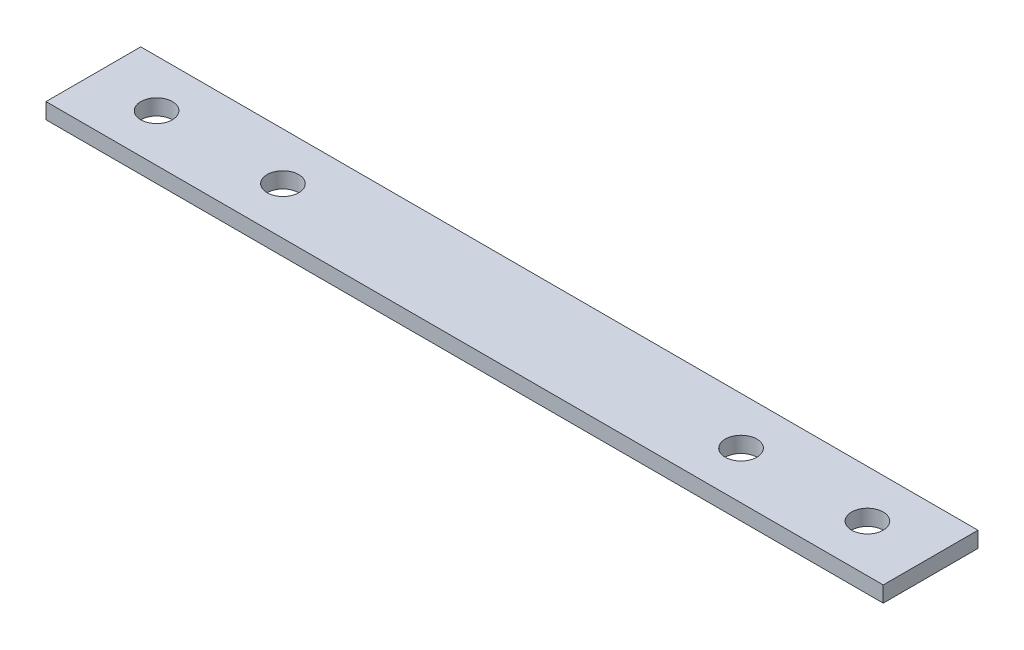
ISO-10303-21;
HEADER;
FILE_DESCRIPTION(('STEP AP214'),'2;1');
FILE_NAME('part.step','',(''),(''),'','','');
FILE_SCHEMA(('AUTOMOTIVE_DESIGN { 1 0 10303 214 1 1 1 1 }'));
ENDSEC;
DATA;
#1=APPLICATION_CONTEXT('core data for automotive mechanical design processes');
#2=APPLICATION_PROTOCOL_DEFINITION('international standard','automotive_design',2000,#1);
#3=PRODUCT_CONTEXT('',#1,'mechanical');
#4=PRODUCT('Part','Part','',(#3));
#5=PRODUCT_RELATED_PRODUCT_CATEGORY('part','',(#4));
#6=PRODUCT_DEFINITION_FORMATION('','',#4);
#7=PRODUCT_DEFINITION_CONTEXT('part definition',#1,'design');
#8=PRODUCT_DEFINITION('design','',#6,#7);
#9=PRODUCT_DEFINITION_SHAPE('','',#8);
#10=(LENGTH_UNIT() NAMED_UNIT(*) SI_UNIT(.MILLI.,.METRE.));
#11=(NAMED_UNIT(*) PLANE_ANGLE_UNIT() SI_UNIT($,.RADIAN.));
#12=(NAMED_UNIT(*) SI_UNIT($,.STERADIAN.) SOLID_ANGLE_UNIT());
#13=UNCERTAINTY_MEASURE_WITH_UNIT(LENGTH_MEASURE(1.E-05),#10,'distance_accuracy_value','');
#14=(GEOMETRIC_REPRESENTATION_CONTEXT(3) GLOBAL_UNCERTAINTY_ASSIGNED_CONTEXT((#13)) GLOBAL_UNIT_ASSIGNED_CONTEXT((#10,
#11,#12)) REPRESENTATION_CONTEXT('',''));
#15=CARTESIAN_POINT('',(0.,0.,0.));
#16=DIRECTION('',(0.,0.,1.));
#17=DIRECTION('',(1.,0.,0.));
#18=AXIS2_PLACEMENT_3D('',#15,#16,#17);
#19=CARTESIAN_POINT('',(-67.31,-12.7,-7.62));
#20=DIRECTION('',(-1.,0.,0.));
#21=DIRECTION('',(0.,0.,1.));
#22=AXIS2_PLACEMENT_3D('',#19,#20,#21);
#23=PLANE('',#22);
#24=DIRECTION('',(0.,0.,1.));
#25=VECTOR('',#24,1.);
#26=CARTESIAN_POINT('',(-67.31,-10.16,-7.62));
#27=LINE('',#26,#25);
#28=CARTESIAN_POINT('',(-67.31,-10.16,-7.62));
#29=VERTEX_POINT('',#28);
#30=CARTESIAN_POINT('',(-67.31,-10.16,7.62));
#31=VERTEX_POINT('',#30);
#32=EDGE_CURVE('E100',#29,#31,#27,.T.);
#33=ORIENTED_EDGE('',*,*,#32,.F.);
#34=DIRECTION('',(0.,1.,0.));
#35=VECTOR('',#34,1.);
#36=CARTESIAN_POINT('',(-67.31,-12.7,-7.62));
#37=LINE('',#36,#35);
#38=CARTESIAN_POINT('',(-67.31,-12.7,-7.62));
#39=VERTEX_POINT('',#38);
#40=EDGE_CURVE('E11',#39,#29,#37,.T.);
#41=ORIENTED_EDGE('',*,*,#40,.F.);
#42=DIRECTION('',(0.,0.,1.));
#43=VECTOR('',#42,1.);
#44=CARTESIAN_POINT('',(-67.31,-12.7,-7.62));
#45=LINE('',#44,#43);
#46=CARTESIAN_POINT('',(-67.31,-12.7,7.62));
#47=VERTEX_POINT('',#46);
#48=EDGE_CURVE('E93',#39,#47,#45,.T.);
#49=ORIENTED_EDGE('',*,*,#48,.T.);
#50=DIRECTION('',(0.,1.,0.));
#51=VECTOR('',#50,1.);
#52=CARTESIAN_POINT('',(-67.31,-12.7,7.62));
#53=LINE('',#52,#51);
#54=EDGE_CURVE('E38',#47,#31,#53,.T.);
#55=ORIENTED_EDGE('',*,*,#54,.T.);
#56=EDGE_LOOP('',(#33,#41,#49,#55));
#57=FACE_BOUND('',#56,.T.);
#58=ADVANCED_FACE('F35',(#57),#23,.T.);
#59=CARTESIAN_POINT('',(-67.31,-12.7,-7.62));
#60=DIRECTION('',(0.,0.,-1.));
#61=DIRECTION('',(-1.,0.,0.));
#62=AXIS2_PLACEMENT_3D('',#59,#60,#61);
#63=PLANE('',#62);
#64=DIRECTION('',(-1.,0.,0.));
#65=VECTOR('',#64,1.);
#66=CARTESIAN_POINT('',(-67.31,-10.16,-7.62));
#67=LINE('',#66,#65);
#68=CARTESIAN_POINT('',(67.31,-10.16,-7.62));
#69=VERTEX_POINT('',#68);
#70=EDGE_CURVE('E95',#69,#29,#67,.T.);
#71=ORIENTED_EDGE('',*,*,#70,.F.);
#72=DIRECTION('',(0.,1.,0.));
#73=VECTOR('',#72,1.);
#74=CARTESIAN_POINT('',(67.31,-12.7,-7.62));
#75=LINE('',#74,#73);
#76=CARTESIAN_POINT('',(67.31,-12.7,-7.62));
#77=VERTEX_POINT('',#76);
#78=EDGE_CURVE('E44',#77,#69,#75,.T.);
#79=ORIENTED_EDGE('',*,*,#78,.F.);
#80=DIRECTION('',(-1.,0.,0.));
#81=VECTOR('',#80,1.);
#82=CARTESIAN_POINT('',(-67.31,-12.7,-7.62));
#83=LINE('',#82,#81);
#84=EDGE_CURVE('E90',#77,#39,#83,.T.);
#85=ORIENTED_EDGE('',*,*,#84,.T.);
#86=ORIENTED_EDGE('',*,*,#40,.T.);
#87=EDGE_LOOP('',(#71,#79,#85,#86));
#88=FACE_BOUND('',#87,.T.);
#89=ADVANCED_FACE('F111',(#88),#63,.T.);
#90=CARTESIAN_POINT('',(67.31,-12.7,-7.62));
#91=DIRECTION('',(1.,0.,0.));
#92=DIRECTION('',(0.,0.,-1.));
#93=AXIS2_PLACEMENT_3D('',#90,#91,#92);
#94=PLANE('',#93);
#95=DIRECTION('',(0.,0.,-1.));
#96=VECTOR('',#95,1.);
#97=CARTESIAN_POINT('',(67.31,-10.16,-7.62));
#98=LINE('',#97,#96);
#99=CARTESIAN_POINT('',(67.31,-10.16,7.62));
#100=VERTEX_POINT('',#99);
#101=EDGE_CURVE('E85',#100,#69,#98,.T.);
#102=ORIENTED_EDGE('',*,*,#101,.F.);
#103=DIRECTION('',(0.,1.,0.));
#104=VECTOR('',#103,1.);
#105=CARTESIAN_POINT('',(67.31,-12.7,7.62));
#106=LINE('',#105,#104);
#107=CARTESIAN_POINT('',(67.31,-12.7,7.62));
#108=VERTEX_POINT('',#107);
#109=EDGE_CURVE('E80',#108,#100,#106,.T.);
#110=ORIENTED_EDGE('',*,*,#109,.F.);
#111=DIRECTION('',(0.,0.,-1.));
#112=VECTOR('',#111,1.);
#113=CARTESIAN_POINT('',(67.31,-12.7,-7.62));
#114=LINE('',#113,#112);
#115=EDGE_CURVE('E83',#108,#77,#114,.T.);
#116=ORIENTED_EDGE('',*,*,#115,.T.);
#117=ORIENTED_EDGE('',*,*,#78,.T.);
#118=EDGE_LOOP('',(#102,#110,#116,#117));
#119=FACE_BOUND('',#118,.T.);
#120=ADVANCED_FACE('F82',(#119),#94,.T.);
#121=CARTESIAN_POINT('',(-67.31,-12.7,7.62));
#122=DIRECTION('',(0.,0.,1.));
#123=DIRECTION('',(1.,0.,0.));
#124=AXIS2_PLACEMENT_3D('',#121,#122,#123);
#125=PLANE('',#124);
#126=DIRECTION('',(1.,0.,0.));
#127=VECTOR('',#126,1.);
#128=CARTESIAN_POINT('',(-67.31,-10.16,7.62));
#129=LINE('',#128,#127);
#130=EDGE_CURVE('E103',#31,#100,#129,.T.);
#131=ORIENTED_EDGE('',*,*,#130,.F.);
#132=ORIENTED_EDGE('',*,*,#54,.F.);
#133=DIRECTION('',(1.,0.,0.));
#134=VECTOR('',#133,1.);
#135=CARTESIAN_POINT('',(-67.31,-12.7,7.62));
#136=LINE('',#135,#134);
#137=EDGE_CURVE('E89',#47,#108,#136,.T.);
#138=ORIENTED_EDGE('',*,*,#137,.T.);
#139=ORIENTED_EDGE('',*,*,#109,.T.);
#140=EDGE_LOOP('',(#131,#132,#138,#139));
#141=FACE_BOUND('',#140,.T.);
#142=ADVANCED_FACE('F92',(#141),#125,.T.);
#143=CARTESIAN_POINT('',(0.,-12.7,0.));
#144=DIRECTION('',(0.,1.,0.));
#145=DIRECTION('',(0.,0.,1.));
#146=AXIS2_PLACEMENT_3D('',#143,#144,#145);
#147=PLANE('',#146);
#148=CARTESIAN_POINT('',(36.83,-12.7,0.));
#149=DIRECTION('',(0.,1.,0.));
#150=DIRECTION('',(0.,0.,1.));
#151=AXIS2_PLACEMENT_3D('',#148,#149,#150);
#152=CIRCLE('',#151,2.54);
#153=CARTESIAN_POINT('',(36.83,-12.7,2.54));
#154=VERTEX_POINT('',#153);
#155=EDGE_CURVE('E152',#154,#154,#152,.T.);
#156=ORIENTED_EDGE('',*,*,#155,.T.);
#157=EDGE_LOOP('',(#156));
#158=FACE_BOUND('',#157,.T.);
#159=CARTESIAN_POINT('',(-36.83,-12.7,0.));
#160=DIRECTION('',(0.,1.,0.));
#161=DIRECTION('',(0.,0.,1.));
#162=AXIS2_PLACEMENT_3D('',#159,#160,#161);
#163=CIRCLE('',#162,2.54);
#164=CARTESIAN_POINT('',(-36.83,-12.7,2.54));
#165=VERTEX_POINT('',#164);
#166=EDGE_CURVE('E160',#165,#165,#163,.T.);
#167=ORIENTED_EDGE('',*,*,#166,.T.);
#168=EDGE_LOOP('',(#167));
#169=FACE_BOUND('',#168,.T.);
#170=CARTESIAN_POINT('',(57.15,-12.7,0.));
#171=DIRECTION('',(0.,1.,0.));
#172=DIRECTION('',(0.,0.,1.));
#173=AXIS2_PLACEMENT_3D('',#170,#171,#172);
#174=CIRCLE('',#173,2.54);
#175=CARTESIAN_POINT('',(57.15,-12.7,2.54));
#176=VERTEX_POINT('',#175);
#177=EDGE_CURVE('E166',#176,#176,#174,.T.);
#178=ORIENTED_EDGE('',*,*,#177,.T.);
#179=EDGE_LOOP('',(#178));
#180=FACE_BOUND('',#179,.T.);
#181=CARTESIAN_POINT('',(-57.15,-12.7,0.));
#182=DIRECTION('',(0.,1.,0.));
#183=DIRECTION('',(0.,0.,1.));
#184=AXIS2_PLACEMENT_3D('',#181,#182,#183);
#185=CIRCLE('',#184,2.54);
#186=CARTESIAN_POINT('',(-57.15,-12.7,2.54));
#187=VERTEX_POINT('',#186);
#188=EDGE_CURVE('E104',#187,#187,#185,.T.);
#189=ORIENTED_EDGE('',*,*,#188,.T.);
#190=EDGE_LOOP('',(#189));
#191=FACE_BOUND('',#190,.T.);
#192=ORIENTED_EDGE('',*,*,#48,.F.);
#193=ORIENTED_EDGE('',*,*,#84,.F.);
#194=ORIENTED_EDGE('',*,*,#115,.F.);
#195=ORIENTED_EDGE('',*,*,#137,.F.);
#196=EDGE_LOOP('',(#192,#193,#194,#195));
#197=FACE_BOUND('',#196,.T.);
#198=ADVANCED_FACE('F88',(#158,#169,#180,#191,#197),#147,.F.);
#199=CARTESIAN_POINT('',(0.,-10.16,0.));
#200=DIRECTION('',(0.,1.,0.));
#201=DIRECTION('',(0.,0.,1.));
#202=AXIS2_PLACEMENT_3D('',#199,#200,#201);
#203=PLANE('',#202);
#204=CARTESIAN_POINT('',(36.83,-10.16,0.));
#205=DIRECTION('',(0.,1.,0.));
#206=DIRECTION('',(0.,0.,1.));
#207=AXIS2_PLACEMENT_3D('',#204,#205,#206);
#208=CIRCLE('',#207,2.54);
#209=CARTESIAN_POINT('',(36.83,-10.16,2.54));
#210=VERTEX_POINT('',#209);
#211=EDGE_CURVE('E155',#210,#210,#208,.T.);
#212=ORIENTED_EDGE('',*,*,#211,.F.);
#213=EDGE_LOOP('',(#212));
#214=FACE_BOUND('',#213,.T.);
#215=CARTESIAN_POINT('',(-36.83,-10.16,0.));
#216=DIRECTION('',(0.,1.,0.));
#217=DIRECTION('',(0.,0.,1.));
#218=AXIS2_PLACEMENT_3D('',#215,#216,#217);
#219=CIRCLE('',#218,2.54);
#220=CARTESIAN_POINT('',(-36.83,-10.16,2.54));
#221=VERTEX_POINT('',#220);
#222=EDGE_CURVE('E157',#221,#221,#219,.T.);
#223=ORIENTED_EDGE('',*,*,#222,.F.);
#224=EDGE_LOOP('',(#223));
#225=FACE_BOUND('',#224,.T.);
#226=CARTESIAN_POINT('',(57.15,-10.16,0.));
#227=DIRECTION('',(0.,1.,0.));
#228=DIRECTION('',(0.,0.,1.));
#229=AXIS2_PLACEMENT_3D('',#226,#227,#228);
#230=CIRCLE('',#229,2.54);
#231=CARTESIAN_POINT('',(57.15,-10.16,2.54));
#232=VERTEX_POINT('',#231);
#233=EDGE_CURVE('E163',#232,#232,#230,.T.);
#234=ORIENTED_EDGE('',*,*,#233,.F.);
#235=EDGE_LOOP('',(#234));
#236=FACE_BOUND('',#235,.T.);
#237=CARTESIAN_POINT('',(-57.15,-10.16,0.));
#238=DIRECTION('',(0.,1.,0.));
#239=DIRECTION('',(0.,0.,1.));
#240=AXIS2_PLACEMENT_3D('',#237,#238,#239);
#241=CIRCLE('',#240,2.54);
#242=CARTESIAN_POINT('',(-57.15,-10.16,2.54));
#243=VERTEX_POINT('',#242);
#244=EDGE_CURVE('E169',#243,#243,#241,.T.);
#245=ORIENTED_EDGE('',*,*,#244,.F.);
#246=EDGE_LOOP('',(#245));
#247=FACE_BOUND('',#246,.T.);
#248=ORIENTED_EDGE('',*,*,#32,.T.);
#249=ORIENTED_EDGE('',*,*,#130,.T.);
#250=ORIENTED_EDGE('',*,*,#101,.T.);
#251=ORIENTED_EDGE('',*,*,#70,.T.);
#252=EDGE_LOOP('',(#248,#249,#250,#251));
#253=FACE_BOUND('',#252,.T.);
#254=ADVANCED_FACE('F110',(#214,#225,#236,#247,#253),#203,.T.);
#255=CARTESIAN_POINT('',(-57.15,-12.7,0.));
#256=DIRECTION('',(0.,1.,0.));
#257=DIRECTION('',(0.,0.,1.));
#258=AXIS2_PLACEMENT_3D('',#255,#256,#257);
#259=CYLINDRICAL_SURFACE('',#258,2.54);
#260=ORIENTED_EDGE('',*,*,#188,.F.);
#261=EDGE_LOOP('',(#260));
#262=FACE_BOUND('',#261,.T.);
#263=ORIENTED_EDGE('',*,*,#244,.T.);
#264=EDGE_LOOP('',(#263));
#265=FACE_BOUND('',#264,.T.);
#266=ADVANCED_FACE('F129',(#262,#265),#259,.F.);
#267=CARTESIAN_POINT('',(57.15,-12.7,0.));
#268=DIRECTION('',(0.,1.,0.));
#269=DIRECTION('',(0.,0.,1.));
#270=AXIS2_PLACEMENT_3D('',#267,#268,#269);
#271=CYLINDRICAL_SURFACE('',#270,2.54);
#272=ORIENTED_EDGE('',*,*,#177,.F.);
#273=EDGE_LOOP('',(#272));
#274=FACE_BOUND('',#273,.T.);
#275=ORIENTED_EDGE('',*,*,#233,.T.);
#276=EDGE_LOOP('',(#275));
#277=FACE_BOUND('',#276,.T.);
#278=ADVANCED_FACE('F136',(#274,#277),#271,.F.);
#279=CARTESIAN_POINT('',(-36.83,-12.7,0.));
#280=DIRECTION('',(0.,1.,0.));
#281=DIRECTION('',(0.,0.,1.));
#282=AXIS2_PLACEMENT_3D('',#279,#280,#281);
#283=CYLINDRICAL_SURFACE('',#282,2.54);
#284=ORIENTED_EDGE('',*,*,#166,.F.);
#285=EDGE_LOOP('',(#284));
#286=FACE_BOUND('',#285,.T.);
#287=ORIENTED_EDGE('',*,*,#222,.T.);
#288=EDGE_LOOP('',(#287));
#289=FACE_BOUND('',#288,.T.);
#290=ADVANCED_FACE('F140',(#286,#289),#283,.F.);
#291=CARTESIAN_POINT('',(36.83,-12.7,0.));
#292=DIRECTION('',(0.,1.,0.));
#293=DIRECTION('',(0.,0.,1.));
#294=AXIS2_PLACEMENT_3D('',#291,#292,#293);
#295=CYLINDRICAL_SURFACE('',#294,2.54);
#296=ORIENTED_EDGE('',*,*,#155,.F.);
#297=EDGE_LOOP('',(#296));
#298=FACE_BOUND('',#297,.T.);
#299=ORIENTED_EDGE('',*,*,#211,.T.);
#300=EDGE_LOOP('',(#299));
#301=FACE_BOUND('',#300,.T.);
#302=ADVANCED_FACE('F144',(#298,#301),#295,.F.);
#303=CLOSED_SHELL('',(#58,#89,#120,#142,#198,#254,#266,#278,#290,#302));
#304=MANIFOLD_SOLID_BREP('B2',#303);
#305=ADVANCED_BREP_SHAPE_REPRESENTATION('',(#18,#304),#14);
#306=SHAPE_DEFINITION_REPRESENTATION(#9,#305);
ENDSEC;
END-ISO-10303-21;
